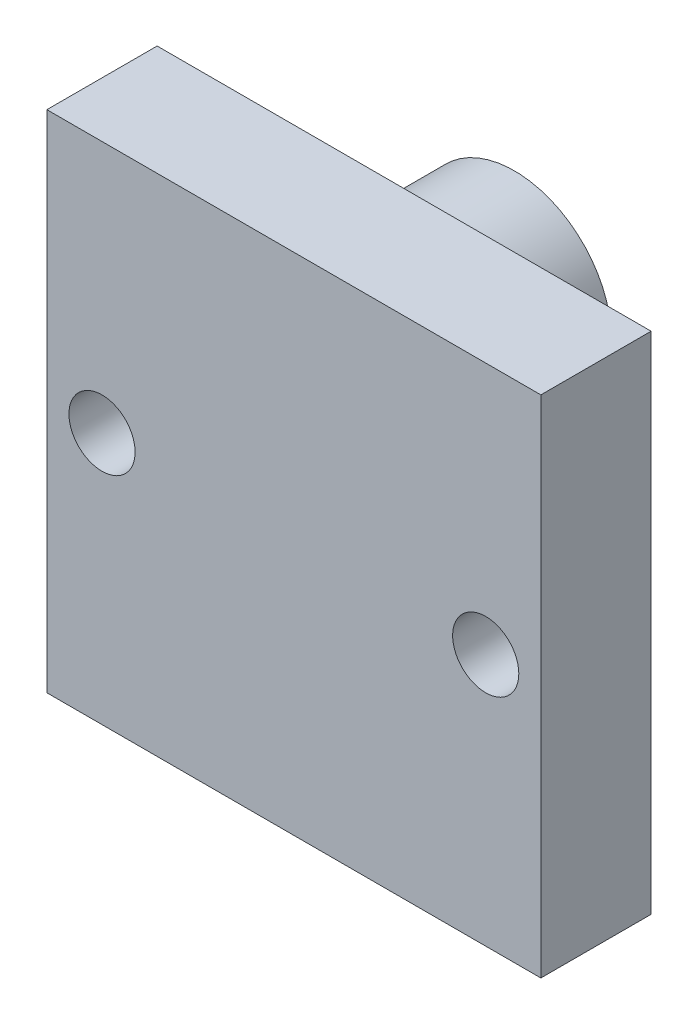
ISO-10303-21;
HEADER;
FILE_DESCRIPTION(('STEP AP214'),'2;1');
FILE_NAME('part.step','',(''),(''),'','','');
FILE_SCHEMA(('AUTOMOTIVE_DESIGN { 1 0 10303 214 1 1 1 1 }'));
ENDSEC;
DATA;
#1=APPLICATION_CONTEXT('core data for automotive mechanical design processes');
#2=APPLICATION_PROTOCOL_DEFINITION('international standard','automotive_design',2000,#1);
#3=PRODUCT_CONTEXT('',#1,'mechanical');
#4=PRODUCT('Part','Part','',(#3));
#5=PRODUCT_RELATED_PRODUCT_CATEGORY('part','',(#4));
#6=PRODUCT_DEFINITION_FORMATION('','',#4);
#7=PRODUCT_DEFINITION_CONTEXT('part definition',#1,'design');
#8=PRODUCT_DEFINITION('design','',#6,#7);
#9=PRODUCT_DEFINITION_SHAPE('','',#8);
#10=(LENGTH_UNIT() NAMED_UNIT(*) SI_UNIT(.MILLI.,.METRE.));
#11=(NAMED_UNIT(*) PLANE_ANGLE_UNIT() SI_UNIT($,.RADIAN.));
#12=(NAMED_UNIT(*) SI_UNIT($,.STERADIAN.) SOLID_ANGLE_UNIT());
#13=UNCERTAINTY_MEASURE_WITH_UNIT(LENGTH_MEASURE(1.E-05),#10,'distance_accuracy_value','');
#14=(GEOMETRIC_REPRESENTATION_CONTEXT(3) GLOBAL_UNCERTAINTY_ASSIGNED_CONTEXT((#13)) GLOBAL_UNIT_ASSIGNED_CONTEXT((#10,
#11,#12)) REPRESENTATION_CONTEXT('',''));
#15=CARTESIAN_POINT('',(0.,0.,0.));
#16=DIRECTION('',(0.,0.,1.));
#17=DIRECTION('',(1.,0.,0.));
#18=AXIS2_PLACEMENT_3D('',#15,#16,#17);
#19=CARTESIAN_POINT('',(11.2,11.45,5.));
#20=DIRECTION('',(-1.,0.,0.));
#21=DIRECTION('',(0.,-1.,0.));
#22=AXIS2_PLACEMENT_3D('',#19,#20,#21);
#23=PLANE('',#22);
#24=DIRECTION('',(0.,1.,0.));
#25=VECTOR('',#24,1.);
#26=CARTESIAN_POINT('',(11.2,11.45,0.));
#27=LINE('',#26,#25);
#28=CARTESIAN_POINT('',(11.2,-11.45,0.));
#29=VERTEX_POINT('',#28);
#30=CARTESIAN_POINT('',(11.2,11.45,0.));
#31=VERTEX_POINT('',#30);
#32=EDGE_CURVE('E112',#29,#31,#27,.T.);
#33=ORIENTED_EDGE('',*,*,#32,.T.);
#34=DIRECTION('',(0.,0.,-1.));
#35=VECTOR('',#34,1.);
#36=CARTESIAN_POINT('',(11.2,11.45,5.));
#37=LINE('',#36,#35);
#38=CARTESIAN_POINT('',(11.2,11.45,5.));
#39=VERTEX_POINT('',#38);
#40=EDGE_CURVE('E50',#39,#31,#37,.T.);
#41=ORIENTED_EDGE('',*,*,#40,.F.);
#42=DIRECTION('',(0.,1.,0.));
#43=VECTOR('',#42,1.);
#44=CARTESIAN_POINT('',(11.2,11.45,5.));
#45=LINE('',#44,#43);
#46=CARTESIAN_POINT('',(11.2,-11.45,5.));
#47=VERTEX_POINT('',#46);
#48=EDGE_CURVE('E94',#47,#39,#45,.T.);
#49=ORIENTED_EDGE('',*,*,#48,.F.);
#50=DIRECTION('',(0.,0.,-1.));
#51=VECTOR('',#50,1.);
#52=CARTESIAN_POINT('',(11.2,-11.45,5.));
#53=LINE('',#52,#51);
#54=EDGE_CURVE('E108',#47,#29,#53,.T.);
#55=ORIENTED_EDGE('',*,*,#54,.T.);
#56=EDGE_LOOP('',(#33,#41,#49,#55));
#57=FACE_BOUND('',#56,.T.);
#58=ADVANCED_FACE('F41',(#57),#23,.F.);
#59=CARTESIAN_POINT('',(-11.2,11.45,5.));
#60=DIRECTION('',(0.,-1.,0.));
#61=DIRECTION('',(0.,0.,-1.));
#62=AXIS2_PLACEMENT_3D('',#59,#60,#61);
#63=PLANE('',#62);
#64=DIRECTION('',(-1.,0.,0.));
#65=VECTOR('',#64,1.);
#66=CARTESIAN_POINT('',(-11.2,11.45,0.));
#67=LINE('',#66,#65);
#68=CARTESIAN_POINT('',(-11.2,11.45,0.));
#69=VERTEX_POINT('',#68);
#70=EDGE_CURVE('E100',#31,#69,#67,.T.);
#71=ORIENTED_EDGE('',*,*,#70,.T.);
#72=DIRECTION('',(0.,0.,-1.));
#73=VECTOR('',#72,1.);
#74=CARTESIAN_POINT('',(-11.2,11.45,5.));
#75=LINE('',#74,#73);
#76=CARTESIAN_POINT('',(-11.2,11.45,5.));
#77=VERTEX_POINT('',#76);
#78=EDGE_CURVE('E98',#77,#69,#75,.T.);
#79=ORIENTED_EDGE('',*,*,#78,.F.);
#80=DIRECTION('',(-1.,0.,0.));
#81=VECTOR('',#80,1.);
#82=CARTESIAN_POINT('',(-11.2,11.45,5.));
#83=LINE('',#82,#81);
#84=EDGE_CURVE('E89',#39,#77,#83,.T.);
#85=ORIENTED_EDGE('',*,*,#84,.F.);
#86=ORIENTED_EDGE('',*,*,#40,.T.);
#87=EDGE_LOOP('',(#71,#79,#85,#86));
#88=FACE_BOUND('',#87,.T.);
#89=ADVANCED_FACE('F99',(#88),#63,.F.);
#90=CARTESIAN_POINT('',(-11.2,11.45,5.));
#91=DIRECTION('',(1.,0.,0.));
#92=DIRECTION('',(0.,1.,0.));
#93=AXIS2_PLACEMENT_3D('',#90,#91,#92);
#94=PLANE('',#93);
#95=DIRECTION('',(0.,-1.,0.));
#96=VECTOR('',#95,1.);
#97=CARTESIAN_POINT('',(-11.2,11.45,0.));
#98=LINE('',#97,#96);
#99=CARTESIAN_POINT('',(-11.2,-11.45,0.));
#100=VERTEX_POINT('',#99);
#101=EDGE_CURVE('E75',#69,#100,#98,.T.);
#102=ORIENTED_EDGE('',*,*,#101,.T.);
#103=DIRECTION('',(0.,0.,-1.));
#104=VECTOR('',#103,1.);
#105=CARTESIAN_POINT('',(-11.2,-11.45,5.));
#106=LINE('',#105,#104);
#107=CARTESIAN_POINT('',(-11.2,-11.45,5.));
#108=VERTEX_POINT('',#107);
#109=EDGE_CURVE('E102',#108,#100,#106,.T.);
#110=ORIENTED_EDGE('',*,*,#109,.F.);
#111=DIRECTION('',(0.,-1.,0.));
#112=VECTOR('',#111,1.);
#113=CARTESIAN_POINT('',(-11.2,11.45,5.));
#114=LINE('',#113,#112);
#115=EDGE_CURVE('E92',#77,#108,#114,.T.);
#116=ORIENTED_EDGE('',*,*,#115,.F.);
#117=ORIENTED_EDGE('',*,*,#78,.T.);
#118=EDGE_LOOP('',(#102,#110,#116,#117));
#119=FACE_BOUND('',#118,.T.);
#120=ADVANCED_FACE('F104',(#119),#94,.F.);
#121=CARTESIAN_POINT('',(-11.2,-11.45,5.));
#122=DIRECTION('',(0.,1.,0.));
#123=DIRECTION('',(0.,0.,1.));
#124=AXIS2_PLACEMENT_3D('',#121,#122,#123);
#125=PLANE('',#124);
#126=DIRECTION('',(1.,0.,0.));
#127=VECTOR('',#126,1.);
#128=CARTESIAN_POINT('',(-11.2,-11.45,0.));
#129=LINE('',#128,#127);
#130=EDGE_CURVE('E81',#100,#29,#129,.T.);
#131=ORIENTED_EDGE('',*,*,#130,.T.);
#132=ORIENTED_EDGE('',*,*,#54,.F.);
#133=DIRECTION('',(1.,0.,0.));
#134=VECTOR('',#133,1.);
#135=CARTESIAN_POINT('',(-11.2,-11.45,5.));
#136=LINE('',#135,#134);
#137=EDGE_CURVE('E58',#108,#47,#136,.T.);
#138=ORIENTED_EDGE('',*,*,#137,.F.);
#139=ORIENTED_EDGE('',*,*,#109,.T.);
#140=EDGE_LOOP('',(#131,#132,#138,#139));
#141=FACE_BOUND('',#140,.T.);
#142=ADVANCED_FACE('F142',(#141),#125,.F.);
#143=CARTESIAN_POINT('',(0.,0.,5.));
#144=DIRECTION('',(0.,0.,1.));
#145=DIRECTION('',(1.,0.,0.));
#146=AXIS2_PLACEMENT_3D('',#143,#144,#145);
#147=PLANE('',#146);
#148=CARTESIAN_POINT('',(-8.7,0.,5.));
#149=DIRECTION('',(0.,0.,1.));
#150=DIRECTION('',(1.,0.,0.));
#151=AXIS2_PLACEMENT_3D('',#148,#149,#150);
#152=CIRCLE('',#151,1.5);
#153=CARTESIAN_POINT('',(-7.2,0.,5.));
#154=VERTEX_POINT('',#153);
#155=EDGE_CURVE('E222',#154,#154,#152,.T.);
#156=ORIENTED_EDGE('',*,*,#155,.F.);
#157=EDGE_LOOP('',(#156));
#158=FACE_BOUND('',#157,.T.);
#159=CARTESIAN_POINT('',(8.7,0.,5.));
#160=DIRECTION('',(0.,0.,1.));
#161=DIRECTION('',(1.,0.,0.));
#162=AXIS2_PLACEMENT_3D('',#159,#160,#161);
#163=CIRCLE('',#162,1.5);
#164=CARTESIAN_POINT('',(10.2,0.,5.));
#165=VERTEX_POINT('',#164);
#166=EDGE_CURVE('E212',#165,#165,#163,.T.);
#167=ORIENTED_EDGE('',*,*,#166,.F.);
#168=EDGE_LOOP('',(#167));
#169=FACE_BOUND('',#168,.T.);
#170=ORIENTED_EDGE('',*,*,#48,.T.);
#171=ORIENTED_EDGE('',*,*,#84,.T.);
#172=ORIENTED_EDGE('',*,*,#115,.T.);
#173=ORIENTED_EDGE('',*,*,#137,.T.);
#174=EDGE_LOOP('',(#170,#171,#172,#173));
#175=FACE_BOUND('',#174,.T.);
#176=ADVANCED_FACE('F90',(#158,#169,#175),#147,.T.);
#177=CARTESIAN_POINT('',(0.,0.,0.));
#178=DIRECTION('',(0.,0.,1.));
#179=DIRECTION('',(1.,0.,0.));
#180=AXIS2_PLACEMENT_3D('',#177,#178,#179);
#181=PLANE('',#180);
#182=CARTESIAN_POINT('',(0.,5.25,0.));
#183=DIRECTION('',(0.,0.,1.));
#184=DIRECTION('',(1.,0.,0.));
#185=AXIS2_PLACEMENT_3D('',#182,#183,#184);
#186=CIRCLE('',#185,4.4);
#187=CARTESIAN_POINT('',(4.4,5.25,0.));
#188=VERTEX_POINT('',#187);
#189=EDGE_CURVE('E11',#188,#188,#186,.F.);
#190=ORIENTED_EDGE('',*,*,#189,.F.);
#191=EDGE_LOOP('',(#190));
#192=FACE_BOUND('',#191,.T.);
#193=CARTESIAN_POINT('',(-8.7,0.,0.));
#194=DIRECTION('',(0.,0.,1.));
#195=DIRECTION('',(1.,0.,0.));
#196=AXIS2_PLACEMENT_3D('',#193,#194,#195);
#197=CIRCLE('',#196,1.5);
#198=CARTESIAN_POINT('',(-7.2,0.,0.));
#199=VERTEX_POINT('',#198);
#200=EDGE_CURVE('E116',#199,#199,#197,.T.);
#201=ORIENTED_EDGE('',*,*,#200,.T.);
#202=EDGE_LOOP('',(#201));
#203=FACE_BOUND('',#202,.T.);
#204=CARTESIAN_POINT('',(8.7,0.,0.));
#205=DIRECTION('',(0.,0.,1.));
#206=DIRECTION('',(1.,0.,0.));
#207=AXIS2_PLACEMENT_3D('',#204,#205,#206);
#208=CIRCLE('',#207,1.5);
#209=CARTESIAN_POINT('',(10.2,0.,0.));
#210=VERTEX_POINT('',#209);
#211=EDGE_CURVE('E216',#210,#210,#208,.T.);
#212=ORIENTED_EDGE('',*,*,#211,.T.);
#213=EDGE_LOOP('',(#212));
#214=FACE_BOUND('',#213,.T.);
#215=ORIENTED_EDGE('',*,*,#32,.F.);
#216=ORIENTED_EDGE('',*,*,#130,.F.);
#217=ORIENTED_EDGE('',*,*,#101,.F.);
#218=ORIENTED_EDGE('',*,*,#70,.F.);
#219=EDGE_LOOP('',(#215,#216,#217,#218));
#220=FACE_BOUND('',#219,.T.);
#221=ADVANCED_FACE('F130',(#192,#203,#214,#220),#181,.F.);
#222=CARTESIAN_POINT('',(8.7,0.,0.));
#223=DIRECTION('',(0.,0.,1.));
#224=DIRECTION('',(1.,0.,0.));
#225=AXIS2_PLACEMENT_3D('',#222,#223,#224);
#226=CYLINDRICAL_SURFACE('',#225,1.5);
#227=ORIENTED_EDGE('',*,*,#211,.F.);
#228=EDGE_LOOP('',(#227));
#229=FACE_BOUND('',#228,.T.);
#230=ORIENTED_EDGE('',*,*,#166,.T.);
#231=EDGE_LOOP('',(#230));
#232=FACE_BOUND('',#231,.T.);
#233=ADVANCED_FACE('F132',(#229,#232),#226,.F.);
#234=CARTESIAN_POINT('',(-8.7,0.,0.));
#235=DIRECTION('',(0.,0.,1.));
#236=DIRECTION('',(1.,0.,0.));
#237=AXIS2_PLACEMENT_3D('',#234,#235,#236);
#238=CYLINDRICAL_SURFACE('',#237,1.5);
#239=ORIENTED_EDGE('',*,*,#200,.F.);
#240=EDGE_LOOP('',(#239));
#241=FACE_BOUND('',#240,.T.);
#242=ORIENTED_EDGE('',*,*,#155,.T.);
#243=EDGE_LOOP('',(#242));
#244=FACE_BOUND('',#243,.T.);
#245=ADVANCED_FACE('F139',(#241,#244),#238,.F.);
#246=CARTESIAN_POINT('',(0.,5.25,-5.));
#247=DIRECTION('',(0.,0.,1.));
#248=DIRECTION('',(1.,0.,0.));
#249=AXIS2_PLACEMENT_3D('',#246,#247,#248);
#250=CYLINDRICAL_SURFACE('',#249,4.4);
#251=CARTESIAN_POINT('',(0.,5.25,-5.));
#252=DIRECTION('',(0.,0.,-1.));
#253=DIRECTION('',(-1.,0.,0.));
#254=AXIS2_PLACEMENT_3D('',#251,#252,#253);
#255=CIRCLE('',#254,4.4);
#256=CARTESIAN_POINT('',(-4.4,5.25,-5.));
#257=VERTEX_POINT('',#256);
#258=EDGE_CURVE('E210',#257,#257,#255,.T.);
#259=ORIENTED_EDGE('',*,*,#258,.F.);
#260=EDGE_LOOP('',(#259));
#261=FACE_BOUND('',#260,.T.);
#262=ORIENTED_EDGE('',*,*,#189,.T.);
#263=EDGE_LOOP('',(#262));
#264=FACE_BOUND('',#263,.T.);
#265=ADVANCED_FACE('F180',(#261,#264),#250,.T.);
#266=CARTESIAN_POINT('',(0.,5.25,-5.));
#267=DIRECTION('',(0.,0.,-1.));
#268=DIRECTION('',(-1.,0.,0.));
#269=AXIS2_PLACEMENT_3D('',#266,#267,#268);
#270=PLANE('',#269);
#271=ORIENTED_EDGE('',*,*,#258,.T.);
#272=EDGE_LOOP('',(#271));
#273=FACE_BOUND('',#272,.T.);
#274=ADVANCED_FACE('F194',(#273),#270,.T.);
#275=CLOSED_SHELL('',(#58,#89,#120,#142,#176,#221,#233,#245,#265,#274));
#276=MANIFOLD_SOLID_BREP('B2',#275);
#277=ADVANCED_BREP_SHAPE_REPRESENTATION('',(#18,#276),#14);
#278=SHAPE_DEFINITION_REPRESENTATION(#9,#277);
ENDSEC;
END-ISO-10303-21;
